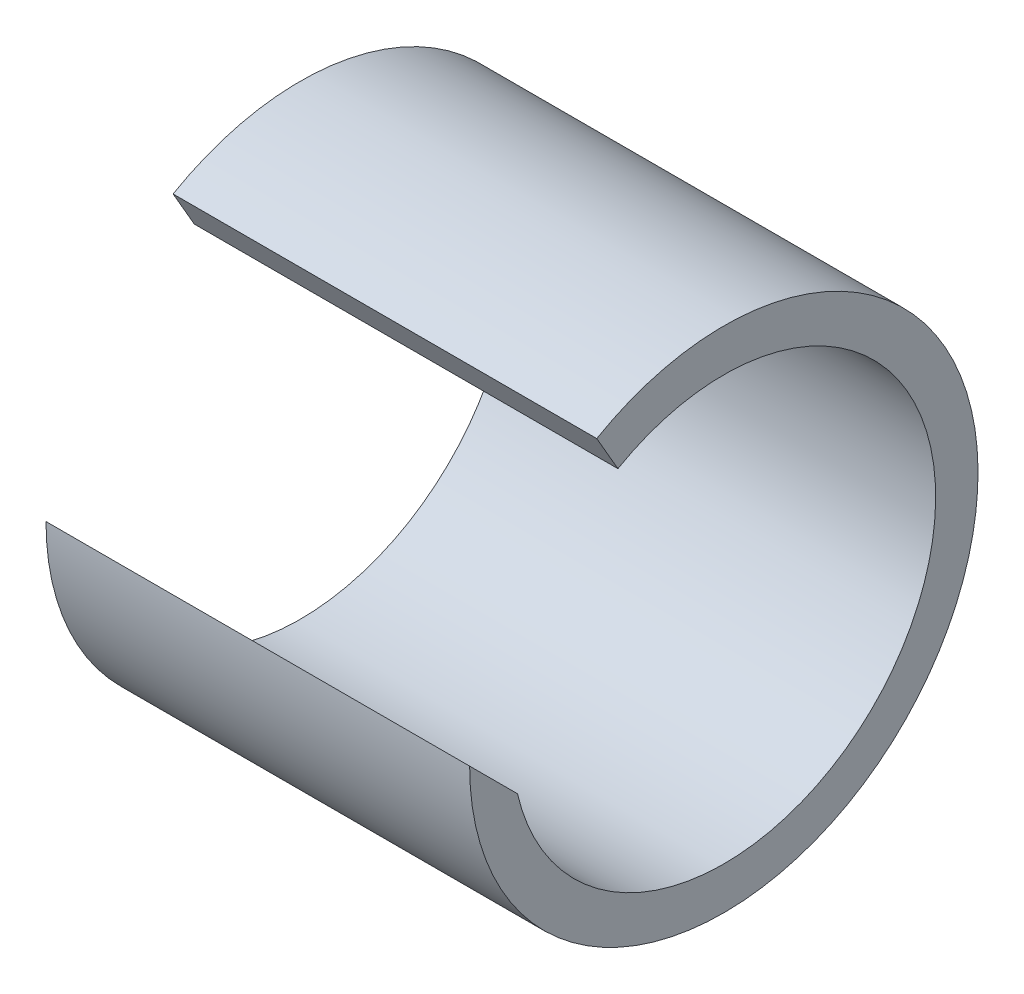
ISO-10303-21;
HEADER;
FILE_DESCRIPTION(('STEP AP214'),'2;1');
FILE_NAME('part.step','',(''),(''),'','','');
FILE_SCHEMA(('AUTOMOTIVE_DESIGN { 1 0 10303 214 1 1 1 1 }'));
ENDSEC;
DATA;
#1=APPLICATION_CONTEXT('core data for automotive mechanical design processes');
#2=APPLICATION_PROTOCOL_DEFINITION('international standard','automotive_design',2000,#1);
#3=PRODUCT_CONTEXT('',#1,'mechanical');
#4=PRODUCT('Part','Part','',(#3));
#5=PRODUCT_RELATED_PRODUCT_CATEGORY('part','',(#4));
#6=PRODUCT_DEFINITION_FORMATION('','',#4);
#7=PRODUCT_DEFINITION_CONTEXT('part definition',#1,'design');
#8=PRODUCT_DEFINITION('design','',#6,#7);
#9=PRODUCT_DEFINITION_SHAPE('','',#8);
#10=(LENGTH_UNIT() NAMED_UNIT(*) SI_UNIT(.MILLI.,.METRE.));
#11=(NAMED_UNIT(*) PLANE_ANGLE_UNIT() SI_UNIT($,.RADIAN.));
#12=(NAMED_UNIT(*) SI_UNIT($,.STERADIAN.) SOLID_ANGLE_UNIT());
#13=UNCERTAINTY_MEASURE_WITH_UNIT(LENGTH_MEASURE(1.E-05),#10,'distance_accuracy_value','');
#14=(GEOMETRIC_REPRESENTATION_CONTEXT(3) GLOBAL_UNCERTAINTY_ASSIGNED_CONTEXT((#13)) GLOBAL_UNIT_ASSIGNED_CONTEXT((#10,
#11,#12)) REPRESENTATION_CONTEXT('',''));
#15=CARTESIAN_POINT('',(0.,0.,0.));
#16=DIRECTION('',(0.,0.,1.));
#17=DIRECTION('',(1.,0.,0.));
#18=AXIS2_PLACEMENT_3D('',#15,#16,#17);
#19=CARTESIAN_POINT('',(31.75,0.,0.));
#20=DIRECTION('',(1.,0.,0.));
#21=DIRECTION('',(0.,0.,-1.));
#22=AXIS2_PLACEMENT_3D('',#19,#20,#21);
#23=PLANE('',#22);
#24=DIRECTION('',(0.,-0.707106781186548,-0.707106781186547));
#25=VECTOR('',#24,1.);
#26=CARTESIAN_POINT('',(31.75,0.,19.05));
#27=LINE('',#26,#25);
#28=CARTESIAN_POINT('',(31.75,0.,19.05));
#29=VERTEX_POINT('',#28);
#30=CARTESIAN_POINT('',(31.75,-3.58511889849638,15.4648811015036));
#31=VERTEX_POINT('',#30);
#32=EDGE_CURVE('E86',#29,#31,#27,.T.);
#33=ORIENTED_EDGE('',*,*,#32,.F.);
#34=CARTESIAN_POINT('',(31.75,0.,0.));
#35=DIRECTION('',(1.,0.,0.));
#36=DIRECTION('',(0.,0.,-1.));
#37=AXIS2_PLACEMENT_3D('',#34,#35,#36);
#38=CIRCLE('',#37,19.05);
#39=CARTESIAN_POINT('',(31.75,16.4977839420936,9.52499999999996));
#40=VERTEX_POINT('',#39);
#41=EDGE_CURVE('E11',#29,#40,#38,.T.);
#42=ORIENTED_EDGE('',*,*,#41,.T.);
#43=DIRECTION('',(0.,0.86602540378444,0.499999999999998));
#44=VECTOR('',#43,1.);
#45=CARTESIAN_POINT('',(31.75,13.748153285078,7.93749999999997));
#46=LINE('',#45,#44);
#47=CARTESIAN_POINT('',(31.75,13.748153285078,7.93749999999997));
#48=VERTEX_POINT('',#47);
#49=EDGE_CURVE('E68',#48,#40,#46,.T.);
#50=ORIENTED_EDGE('',*,*,#49,.F.);
#51=CARTESIAN_POINT('',(31.75,0.,0.));
#52=DIRECTION('',(1.,0.,0.));
#53=DIRECTION('',(0.,0.,-1.));
#54=AXIS2_PLACEMENT_3D('',#51,#52,#53);
#55=CIRCLE('',#54,15.875);
#56=EDGE_CURVE('E88',#31,#48,#55,.T.);
#57=ORIENTED_EDGE('',*,*,#56,.F.);
#58=EDGE_LOOP('',(#33,#42,#50,#57));
#59=FACE_BOUND('',#58,.T.);
#60=ADVANCED_FACE('F34',(#59),#23,.T.);
#61=CARTESIAN_POINT('',(0.,0.,0.));
#62=DIRECTION('',(1.,0.,0.));
#63=DIRECTION('',(0.,0.,-1.));
#64=AXIS2_PLACEMENT_3D('',#61,#62,#63);
#65=PLANE('',#64);
#66=CARTESIAN_POINT('',(0.,0.,0.));
#67=DIRECTION('',(1.,0.,0.));
#68=DIRECTION('',(0.,0.,-1.));
#69=AXIS2_PLACEMENT_3D('',#66,#67,#68);
#70=CIRCLE('',#69,19.05);
#71=CARTESIAN_POINT('',(0.,0.,19.05));
#72=VERTEX_POINT('',#71);
#73=CARTESIAN_POINT('',(0.,16.4977839420936,9.52499999999996));
#74=VERTEX_POINT('',#73);
#75=EDGE_CURVE('E38',#72,#74,#70,.T.);
#76=ORIENTED_EDGE('',*,*,#75,.F.);
#77=DIRECTION('',(0.,-0.707106781186548,-0.707106781186547));
#78=VECTOR('',#77,1.);
#79=CARTESIAN_POINT('',(0.,0.,19.05));
#80=LINE('',#79,#78);
#81=CARTESIAN_POINT('',(0.,-3.58511889849638,15.4648811015036));
#82=VERTEX_POINT('',#81);
#83=EDGE_CURVE('E93',#72,#82,#80,.T.);
#84=ORIENTED_EDGE('',*,*,#83,.T.);
#85=CARTESIAN_POINT('',(0.,0.,0.));
#86=DIRECTION('',(1.,0.,0.));
#87=DIRECTION('',(0.,0.,-1.));
#88=AXIS2_PLACEMENT_3D('',#85,#86,#87);
#89=CIRCLE('',#88,15.875);
#90=CARTESIAN_POINT('',(0.,13.748153285078,7.93749999999997));
#91=VERTEX_POINT('',#90);
#92=EDGE_CURVE('E49',#82,#91,#89,.T.);
#93=ORIENTED_EDGE('',*,*,#92,.T.);
#94=DIRECTION('',(0.,0.86602540378444,0.499999999999998));
#95=VECTOR('',#94,1.);
#96=CARTESIAN_POINT('',(0.,13.748153285078,7.93749999999997));
#97=LINE('',#96,#95);
#98=EDGE_CURVE('E74',#91,#74,#97,.T.);
#99=ORIENTED_EDGE('',*,*,#98,.T.);
#100=EDGE_LOOP('',(#76,#84,#93,#99));
#101=FACE_BOUND('',#100,.T.);
#102=ADVANCED_FACE('F108',(#101),#65,.F.);
#103=CARTESIAN_POINT('',(31.75,0.,0.));
#104=DIRECTION('',(-1.,0.,0.));
#105=DIRECTION('',(0.,0.,1.));
#106=AXIS2_PLACEMENT_3D('',#103,#104,#105);
#107=CYLINDRICAL_SURFACE('',#106,19.05);
#108=ORIENTED_EDGE('',*,*,#75,.T.);
#109=DIRECTION('',(1.,0.,0.));
#110=VECTOR('',#109,1.);
#111=CARTESIAN_POINT('',(0.,16.4977839420936,9.52499999999996));
#112=LINE('',#111,#110);
#113=EDGE_CURVE('E57',#74,#40,#112,.T.);
#114=ORIENTED_EDGE('',*,*,#113,.T.);
#115=ORIENTED_EDGE('',*,*,#41,.F.);
#116=DIRECTION('',(1.,0.,0.));
#117=VECTOR('',#116,1.);
#118=CARTESIAN_POINT('',(0.,0.,19.05));
#119=LINE('',#118,#117);
#120=EDGE_CURVE('E98',#72,#29,#119,.T.);
#121=ORIENTED_EDGE('',*,*,#120,.F.);
#122=EDGE_LOOP('',(#108,#114,#115,#121));
#123=FACE_BOUND('',#122,.T.);
#124=ADVANCED_FACE('F36',(#123),#107,.T.);
#125=CARTESIAN_POINT('',(31.75,0.,0.));
#126=DIRECTION('',(-1.,0.,0.));
#127=DIRECTION('',(0.,0.,1.));
#128=AXIS2_PLACEMENT_3D('',#125,#126,#127);
#129=CYLINDRICAL_SURFACE('',#128,15.875);
#130=DIRECTION('',(1.,0.,0.));
#131=VECTOR('',#130,1.);
#132=CARTESIAN_POINT('',(0.,-3.58511889849638,15.4648811015036));
#133=LINE('',#132,#131);
#134=EDGE_CURVE('E75',#82,#31,#133,.T.);
#135=ORIENTED_EDGE('',*,*,#134,.T.);
#136=ORIENTED_EDGE('',*,*,#56,.T.);
#137=DIRECTION('',(1.,0.,0.));
#138=VECTOR('',#137,1.);
#139=CARTESIAN_POINT('',(0.,13.748153285078,7.93749999999997));
#140=LINE('',#139,#138);
#141=EDGE_CURVE('E71',#91,#48,#140,.T.);
#142=ORIENTED_EDGE('',*,*,#141,.F.);
#143=ORIENTED_EDGE('',*,*,#92,.F.);
#144=EDGE_LOOP('',(#135,#136,#142,#143));
#145=FACE_BOUND('',#144,.T.);
#146=ADVANCED_FACE('F104',(#145),#129,.F.);
#147=CARTESIAN_POINT('',(0.,13.748153285078,7.93749999999997));
#148=DIRECTION('',(0.,0.499999999999998,-0.86602540378444));
#149=DIRECTION('',(0.,0.86602540378444,0.499999999999998));
#150=AXIS2_PLACEMENT_3D('',#147,#148,#149);
#151=PLANE('',#150);
#152=ORIENTED_EDGE('',*,*,#49,.T.);
#153=ORIENTED_EDGE('',*,*,#113,.F.);
#154=ORIENTED_EDGE('',*,*,#98,.F.);
#155=ORIENTED_EDGE('',*,*,#141,.T.);
#156=EDGE_LOOP('',(#152,#153,#154,#155));
#157=FACE_BOUND('',#156,.T.);
#158=ADVANCED_FACE('F69',(#157),#151,.F.);
#159=CARTESIAN_POINT('',(0.,0.,19.05));
#160=DIRECTION('',(0.,-0.707106781186547,0.707106781186548));
#161=DIRECTION('',(0.,-0.707106781186548,-0.707106781186547));
#162=AXIS2_PLACEMENT_3D('',#159,#160,#161);
#163=PLANE('',#162);
#164=ORIENTED_EDGE('',*,*,#32,.T.);
#165=ORIENTED_EDGE('',*,*,#134,.F.);
#166=ORIENTED_EDGE('',*,*,#83,.F.);
#167=ORIENTED_EDGE('',*,*,#120,.T.);
#168=EDGE_LOOP('',(#164,#165,#166,#167));
#169=FACE_BOUND('',#168,.T.);
#170=ADVANCED_FACE('F106',(#169),#163,.F.);
#171=CLOSED_SHELL('',(#60,#102,#124,#146,#158,#170));
#172=MANIFOLD_SOLID_BREP('B2',#171);
#173=ADVANCED_BREP_SHAPE_REPRESENTATION('',(#18,#172),#14);
#174=SHAPE_DEFINITION_REPRESENTATION(#9,#173);
ENDSEC;
END-ISO-10303-21;
